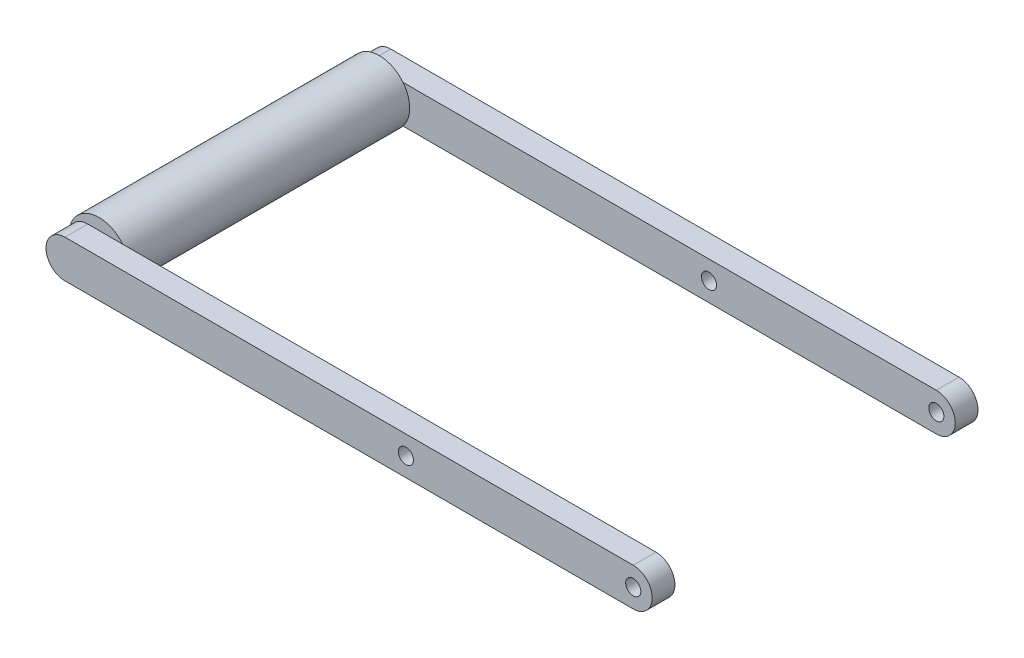
ISO-10303-21;
HEADER;
FILE_DESCRIPTION(('STEP AP214'),'2;1');
FILE_NAME('part.step','',(''),(''),'','','');
FILE_SCHEMA(('AUTOMOTIVE_DESIGN { 1 0 10303 214 1 1 1 1 }'));
ENDSEC;
DATA;
#1=APPLICATION_CONTEXT('core data for automotive mechanical design processes');
#2=APPLICATION_PROTOCOL_DEFINITION('international standard','automotive_design',2000,#1);
#3=PRODUCT_CONTEXT('',#1,'mechanical');
#4=PRODUCT('Part','Part','',(#3));
#5=PRODUCT_RELATED_PRODUCT_CATEGORY('part','',(#4));
#6=PRODUCT_DEFINITION_FORMATION('','',#4);
#7=PRODUCT_DEFINITION_CONTEXT('part definition',#1,'design');
#8=PRODUCT_DEFINITION('design','',#6,#7);
#9=PRODUCT_DEFINITION_SHAPE('','',#8);
#10=(LENGTH_UNIT() NAMED_UNIT(*) SI_UNIT(.MILLI.,.METRE.));
#11=(NAMED_UNIT(*) PLANE_ANGLE_UNIT() SI_UNIT($,.RADIAN.));
#12=(NAMED_UNIT(*) SI_UNIT($,.STERADIAN.) SOLID_ANGLE_UNIT());
#13=UNCERTAINTY_MEASURE_WITH_UNIT(LENGTH_MEASURE(1.E-05),#10,'distance_accuracy_value','');
#14=(GEOMETRIC_REPRESENTATION_CONTEXT(3) GLOBAL_UNCERTAINTY_ASSIGNED_CONTEXT((#13)) GLOBAL_UNIT_ASSIGNED_CONTEXT((#10,
#11,#12)) REPRESENTATION_CONTEXT('',''));
#15=CARTESIAN_POINT('',(0.,0.,0.));
#16=DIRECTION('',(0.,0.,1.));
#17=DIRECTION('',(1.,0.,0.));
#18=AXIS2_PLACEMENT_3D('',#15,#16,#17);
#19=CARTESIAN_POINT('',(-375.,0.,400.));
#20=DIRECTION('',(0.,0.,1.));
#21=DIRECTION('',(1.,0.,0.));
#22=AXIS2_PLACEMENT_3D('',#19,#20,#21);
#23=CYLINDRICAL_SURFACE('',#22,25.);
#24=DIRECTION('',(0.,0.,1.));
#25=VECTOR('',#24,1.);
#26=CARTESIAN_POINT('',(-375.,25.,400.));
#27=LINE('',#26,#25);
#28=CARTESIAN_POINT('',(-375.,25.,400.));
#29=VERTEX_POINT('',#28);
#30=CARTESIAN_POINT('',(-375.,25.,430.));
#31=VERTEX_POINT('',#30);
#32=EDGE_CURVE('E182',#29,#31,#27,.T.);
#33=ORIENTED_EDGE('',*,*,#32,.F.);
#34=CARTESIAN_POINT('',(-375.,0.,400.));
#35=DIRECTION('',(0.,0.,1.));
#36=DIRECTION('',(1.,0.,0.));
#37=AXIS2_PLACEMENT_3D('',#34,#35,#36);
#38=CIRCLE('',#37,25.);
#39=CARTESIAN_POINT('',(-375.,-25.,400.));
#40=VERTEX_POINT('',#39);
#41=EDGE_CURVE('E11',#40,#29,#38,.F.);
#42=ORIENTED_EDGE('',*,*,#41,.F.);
#43=DIRECTION('',(0.,0.,1.));
#44=VECTOR('',#43,1.);
#45=CARTESIAN_POINT('',(-375.,-25.,400.));
#46=LINE('',#45,#44);
#47=CARTESIAN_POINT('',(-375.,-25.,430.));
#48=VERTEX_POINT('',#47);
#49=EDGE_CURVE('E185',#48,#40,#46,.F.);
#50=ORIENTED_EDGE('',*,*,#49,.F.);
#51=CARTESIAN_POINT('',(-375.,0.,430.));
#52=DIRECTION('',(0.,0.,-1.));
#53=DIRECTION('',(-1.,0.,0.));
#54=AXIS2_PLACEMENT_3D('',#51,#52,#53);
#55=CIRCLE('',#54,25.);
#56=EDGE_CURVE('E48',#31,#48,#55,.F.);
#57=ORIENTED_EDGE('',*,*,#56,.F.);
#58=EDGE_LOOP('',(#33,#42,#50,#57));
#59=FACE_BOUND('',#58,.T.);
#60=ADVANCED_FACE('F39',(#59),#23,.T.);
#61=CARTESIAN_POINT('',(375.,0.,430.));
#62=DIRECTION('',(0.,0.,1.));
#63=DIRECTION('',(1.,0.,0.));
#64=AXIS2_PLACEMENT_3D('',#61,#62,#63);
#65=CYLINDRICAL_SURFACE('',#64,25.);
#66=DIRECTION('',(0.,0.,1.));
#67=VECTOR('',#66,1.);
#68=CARTESIAN_POINT('',(375.,25.,400.));
#69=LINE('',#68,#67);
#70=CARTESIAN_POINT('',(375.,25.,430.));
#71=VERTEX_POINT('',#70);
#72=CARTESIAN_POINT('',(375.,25.,400.));
#73=VERTEX_POINT('',#72);
#74=EDGE_CURVE('E171',#71,#73,#69,.F.);
#75=ORIENTED_EDGE('',*,*,#74,.F.);
#76=CARTESIAN_POINT('',(375.,0.,430.));
#77=DIRECTION('',(0.,0.,-1.));
#78=DIRECTION('',(-1.,0.,0.));
#79=AXIS2_PLACEMENT_3D('',#76,#77,#78);
#80=CIRCLE('',#79,25.);
#81=CARTESIAN_POINT('',(375.,-25.,430.));
#82=VERTEX_POINT('',#81);
#83=EDGE_CURVE('E178',#82,#71,#80,.F.);
#84=ORIENTED_EDGE('',*,*,#83,.F.);
#85=DIRECTION('',(0.,0.,1.));
#86=VECTOR('',#85,1.);
#87=CARTESIAN_POINT('',(375.,-25.,400.));
#88=LINE('',#87,#86);
#89=CARTESIAN_POINT('',(375.,-25.,400.));
#90=VERTEX_POINT('',#89);
#91=EDGE_CURVE('E174',#90,#82,#88,.T.);
#92=ORIENTED_EDGE('',*,*,#91,.F.);
#93=CARTESIAN_POINT('',(375.,0.,400.));
#94=DIRECTION('',(0.,0.,-1.));
#95=DIRECTION('',(-1.,0.,0.));
#96=AXIS2_PLACEMENT_3D('',#93,#94,#95);
#97=CIRCLE('',#96,25.);
#98=EDGE_CURVE('E180',#73,#90,#97,.T.);
#99=ORIENTED_EDGE('',*,*,#98,.F.);
#100=EDGE_LOOP('',(#75,#84,#92,#99));
#101=FACE_BOUND('',#100,.T.);
#102=ADVANCED_FACE('F250',(#101),#65,.T.);
#103=CARTESIAN_POINT('',(-375.,0.,0.));
#104=DIRECTION('',(0.,0.,-1.));
#105=DIRECTION('',(-1.,0.,0.));
#106=AXIS2_PLACEMENT_3D('',#103,#104,#105);
#107=CYLINDRICAL_SURFACE('',#106,25.);
#108=DIRECTION('',(0.,0.,-1.));
#109=VECTOR('',#108,1.);
#110=CARTESIAN_POINT('',(-375.,25.,30.));
#111=LINE('',#110,#109);
#112=CARTESIAN_POINT('',(-375.,25.,0.));
#113=VERTEX_POINT('',#112);
#114=CARTESIAN_POINT('',(-375.,25.,30.));
#115=VERTEX_POINT('',#114);
#116=EDGE_CURVE('E143',#113,#115,#111,.F.);
#117=ORIENTED_EDGE('',*,*,#116,.F.);
#118=CARTESIAN_POINT('',(-375.,0.,0.));
#119=DIRECTION('',(0.,0.,1.));
#120=DIRECTION('',(1.,0.,0.));
#121=AXIS2_PLACEMENT_3D('',#118,#119,#120);
#122=CIRCLE('',#121,25.);
#123=CARTESIAN_POINT('',(-375.,-25.,0.));
#124=VERTEX_POINT('',#123);
#125=EDGE_CURVE('E166',#124,#113,#122,.F.);
#126=ORIENTED_EDGE('',*,*,#125,.F.);
#127=DIRECTION('',(0.,0.,-1.));
#128=VECTOR('',#127,1.);
#129=CARTESIAN_POINT('',(-375.,-25.,30.));
#130=LINE('',#129,#128);
#131=CARTESIAN_POINT('',(-375.,-25.,30.));
#132=VERTEX_POINT('',#131);
#133=EDGE_CURVE('E163',#132,#124,#130,.T.);
#134=ORIENTED_EDGE('',*,*,#133,.F.);
#135=CARTESIAN_POINT('',(-375.,0.,30.));
#136=DIRECTION('',(0.,0.,1.));
#137=DIRECTION('',(1.,0.,0.));
#138=AXIS2_PLACEMENT_3D('',#135,#136,#137);
#139=CIRCLE('',#138,25.);
#140=EDGE_CURVE('E168',#115,#132,#139,.T.);
#141=ORIENTED_EDGE('',*,*,#140,.F.);
#142=EDGE_LOOP('',(#117,#126,#134,#141));
#143=FACE_BOUND('',#142,.T.);
#144=ADVANCED_FACE('F254',(#143),#107,.T.);
#145=CARTESIAN_POINT('',(375.,0.,30.));
#146=DIRECTION('',(0.,0.,-1.));
#147=DIRECTION('',(-1.,0.,0.));
#148=AXIS2_PLACEMENT_3D('',#145,#146,#147);
#149=CYLINDRICAL_SURFACE('',#148,25.);
#150=DIRECTION('',(0.,0.,-1.));
#151=VECTOR('',#150,1.);
#152=CARTESIAN_POINT('',(375.,25.,30.));
#153=LINE('',#152,#151);
#154=CARTESIAN_POINT('',(375.,25.,30.));
#155=VERTEX_POINT('',#154);
#156=CARTESIAN_POINT('',(375.,25.,0.));
#157=VERTEX_POINT('',#156);
#158=EDGE_CURVE('E124',#155,#157,#153,.T.);
#159=ORIENTED_EDGE('',*,*,#158,.F.);
#160=CARTESIAN_POINT('',(375.,0.,30.));
#161=DIRECTION('',(0.,0.,1.));
#162=DIRECTION('',(1.,0.,0.));
#163=AXIS2_PLACEMENT_3D('',#160,#161,#162);
#164=CIRCLE('',#163,25.);
#165=CARTESIAN_POINT('',(375.,-25.,30.));
#166=VERTEX_POINT('',#165);
#167=EDGE_CURVE('E133',#166,#155,#164,.T.);
#168=ORIENTED_EDGE('',*,*,#167,.F.);
#169=DIRECTION('',(0.,0.,-1.));
#170=VECTOR('',#169,1.);
#171=CARTESIAN_POINT('',(375.,-25.,30.));
#172=LINE('',#171,#170);
#173=CARTESIAN_POINT('',(375.,-25.,0.));
#174=VERTEX_POINT('',#173);
#175=EDGE_CURVE('E155',#174,#166,#172,.F.);
#176=ORIENTED_EDGE('',*,*,#175,.F.);
#177=CARTESIAN_POINT('',(375.,0.,0.));
#178=DIRECTION('',(0.,0.,1.));
#179=DIRECTION('',(1.,0.,0.));
#180=AXIS2_PLACEMENT_3D('',#177,#178,#179);
#181=CIRCLE('',#180,25.);
#182=EDGE_CURVE('E159',#157,#174,#181,.F.);
#183=ORIENTED_EDGE('',*,*,#182,.F.);
#184=EDGE_LOOP('',(#159,#168,#176,#183));
#185=FACE_BOUND('',#184,.T.);
#186=ADVANCED_FACE('F301',(#185),#149,.T.);
#187=CARTESIAN_POINT('',(-400.,25.,30.));
#188=DIRECTION('',(0.,-1.,0.));
#189=DIRECTION('',(0.,0.,-1.));
#190=AXIS2_PLACEMENT_3D('',#187,#188,#189);
#191=PLANE('',#190);
#192=DIRECTION('',(-1.,0.,0.));
#193=VECTOR('',#192,1.);
#194=CARTESIAN_POINT('',(-400.,25.,0.));
#195=LINE('',#194,#193);
#196=EDGE_CURVE('E151',#157,#113,#195,.T.);
#197=ORIENTED_EDGE('',*,*,#196,.T.);
#198=ORIENTED_EDGE('',*,*,#116,.T.);
#199=DIRECTION('',(-1.,0.,0.));
#200=VECTOR('',#199,1.);
#201=CARTESIAN_POINT('',(-400.,25.,30.));
#202=LINE('',#201,#200);
#203=CARTESIAN_POINT('',(-328.831625359183,25.,30.));
#204=VERTEX_POINT('',#203);
#205=EDGE_CURVE('E118',#204,#115,#202,.T.);
#206=ORIENTED_EDGE('',*,*,#205,.F.);
#207=EDGE_CURVE('E129',#155,#204,#202,.T.);
#208=ORIENTED_EDGE('',*,*,#207,.F.);
#209=ORIENTED_EDGE('',*,*,#158,.T.);
#210=EDGE_LOOP('',(#197,#198,#206,#208,#209));
#211=FACE_BOUND('',#210,.T.);
#212=ADVANCED_FACE('F141',(#211),#191,.F.);
#213=CARTESIAN_POINT('',(-400.,-25.,30.));
#214=DIRECTION('',(0.,1.,0.));
#215=DIRECTION('',(0.,0.,1.));
#216=AXIS2_PLACEMENT_3D('',#213,#214,#215);
#217=PLANE('',#216);
#218=DIRECTION('',(1.,0.,0.));
#219=VECTOR('',#218,1.);
#220=CARTESIAN_POINT('',(-400.,-25.,30.));
#221=LINE('',#220,#219);
#222=CARTESIAN_POINT('',(-328.831625359183,-25.,30.));
#223=VERTEX_POINT('',#222);
#224=EDGE_CURVE('E120',#132,#223,#221,.T.);
#225=ORIENTED_EDGE('',*,*,#224,.F.);
#226=ORIENTED_EDGE('',*,*,#133,.T.);
#227=DIRECTION('',(1.,0.,0.));
#228=VECTOR('',#227,1.);
#229=CARTESIAN_POINT('',(-400.,-25.,0.));
#230=LINE('',#229,#228);
#231=EDGE_CURVE('E144',#124,#174,#230,.T.);
#232=ORIENTED_EDGE('',*,*,#231,.T.);
#233=ORIENTED_EDGE('',*,*,#175,.T.);
#234=EDGE_CURVE('E137',#223,#166,#221,.T.);
#235=ORIENTED_EDGE('',*,*,#234,.F.);
#236=EDGE_LOOP('',(#225,#226,#232,#233,#235));
#237=FACE_BOUND('',#236,.T.);
#238=ADVANCED_FACE('F292',(#237),#217,.F.);
#239=CARTESIAN_POINT('',(0.,0.,30.));
#240=DIRECTION('',(0.,0.,1.));
#241=DIRECTION('',(1.,0.,0.));
#242=AXIS2_PLACEMENT_3D('',#239,#240,#241);
#243=PLANE('',#242);
#244=CARTESIAN_POINT('',(375.,0.,30.));
#245=DIRECTION('',(0.,0.,1.));
#246=DIRECTION('',(1.,0.,0.));
#247=AXIS2_PLACEMENT_3D('',#244,#245,#246);
#248=CIRCLE('',#247,9.99999999999998);
#249=CARTESIAN_POINT('',(385.,0.,30.));
#250=VERTEX_POINT('',#249);
#251=EDGE_CURVE('E222',#250,#250,#248,.T.);
#252=ORIENTED_EDGE('',*,*,#251,.F.);
#253=EDGE_LOOP('',(#252));
#254=FACE_BOUND('',#253,.T.);
#255=CARTESIAN_POINT('',(75.,0.,30.));
#256=DIRECTION('',(0.,0.,1.));
#257=DIRECTION('',(1.,0.,0.));
#258=AXIS2_PLACEMENT_3D('',#255,#256,#257);
#259=CIRCLE('',#258,9.99999999999998);
#260=CARTESIAN_POINT('',(85.,0.,30.));
#261=VERTEX_POINT('',#260);
#262=EDGE_CURVE('E209',#261,#261,#259,.T.);
#263=ORIENTED_EDGE('',*,*,#262,.F.);
#264=EDGE_LOOP('',(#263));
#265=FACE_BOUND('',#264,.T.);
#266=ORIENTED_EDGE('',*,*,#234,.T.);
#267=ORIENTED_EDGE('',*,*,#167,.T.);
#268=ORIENTED_EDGE('',*,*,#207,.T.);
#269=CARTESIAN_POINT('',(-360.056615351175,0.,30.));
#270=DIRECTION('',(0.,0.,1.));
#271=DIRECTION('',(1.,0.,0.));
#272=AXIS2_PLACEMENT_3D('',#269,#270,#271);
#273=CIRCLE('',#272,40.);
#274=EDGE_CURVE('E125',#223,#204,#273,.T.);
#275=ORIENTED_EDGE('',*,*,#274,.F.);
#276=EDGE_LOOP('',(#266,#267,#268,#275));
#277=FACE_BOUND('',#276,.T.);
#278=ADVANCED_FACE('F131',(#254,#265,#277),#243,.T.);
#279=CARTESIAN_POINT('',(0.,0.,0.));
#280=DIRECTION('',(0.,0.,1.));
#281=DIRECTION('',(1.,0.,0.));
#282=AXIS2_PLACEMENT_3D('',#279,#280,#281);
#283=PLANE('',#282);
#284=CARTESIAN_POINT('',(375.,0.,0.));
#285=DIRECTION('',(0.,0.,1.));
#286=DIRECTION('',(1.,0.,0.));
#287=AXIS2_PLACEMENT_3D('',#284,#285,#286);
#288=CIRCLE('',#287,9.99999999999998);
#289=CARTESIAN_POINT('',(385.,0.,0.));
#290=VERTEX_POINT('',#289);
#291=EDGE_CURVE('E228',#290,#290,#288,.T.);
#292=ORIENTED_EDGE('',*,*,#291,.T.);
#293=EDGE_LOOP('',(#292));
#294=FACE_BOUND('',#293,.T.);
#295=CARTESIAN_POINT('',(75.,0.,0.));
#296=DIRECTION('',(0.,0.,1.));
#297=DIRECTION('',(1.,0.,0.));
#298=AXIS2_PLACEMENT_3D('',#295,#296,#297);
#299=CIRCLE('',#298,9.99999999999998);
#300=CARTESIAN_POINT('',(85.,0.,0.));
#301=VERTEX_POINT('',#300);
#302=EDGE_CURVE('E219',#301,#301,#299,.T.);
#303=ORIENTED_EDGE('',*,*,#302,.T.);
#304=EDGE_LOOP('',(#303));
#305=FACE_BOUND('',#304,.T.);
#306=ORIENTED_EDGE('',*,*,#231,.F.);
#307=ORIENTED_EDGE('',*,*,#125,.T.);
#308=ORIENTED_EDGE('',*,*,#196,.F.);
#309=ORIENTED_EDGE('',*,*,#182,.T.);
#310=EDGE_LOOP('',(#306,#307,#308,#309));
#311=FACE_BOUND('',#310,.T.);
#312=ADVANCED_FACE('F235',(#294,#305,#311),#283,.F.);
#313=CARTESIAN_POINT('',(-360.056615351175,0.,30.));
#314=DIRECTION('',(0.,0.,1.));
#315=DIRECTION('',(1.,0.,0.));
#316=AXIS2_PLACEMENT_3D('',#313,#314,#315);
#317=PLANE('',#316);
#318=EDGE_CURVE('E114',#204,#223,#273,.T.);
#319=ORIENTED_EDGE('',*,*,#318,.F.);
#320=ORIENTED_EDGE('',*,*,#205,.T.);
#321=ORIENTED_EDGE('',*,*,#140,.T.);
#322=ORIENTED_EDGE('',*,*,#224,.T.);
#323=EDGE_LOOP('',(#319,#320,#321,#322));
#324=FACE_BOUND('',#323,.T.);
#325=ADVANCED_FACE('F116',(#324),#317,.F.);
#326=CARTESIAN_POINT('',(-360.056615351175,0.,400.));
#327=DIRECTION('',(0.,0.,-1.));
#328=DIRECTION('',(-1.,0.,0.));
#329=AXIS2_PLACEMENT_3D('',#326,#327,#328);
#330=CYLINDRICAL_SURFACE('',#329,40.);
#331=CARTESIAN_POINT('',(-360.056615351175,0.,400.));
#332=DIRECTION('',(0.,0.,1.));
#333=DIRECTION('',(1.,0.,0.));
#334=AXIS2_PLACEMENT_3D('',#331,#332,#333);
#335=CIRCLE('',#334,40.);
#336=CARTESIAN_POINT('',(-328.831625359183,25.,400.));
#337=VERTEX_POINT('',#336);
#338=CARTESIAN_POINT('',(-328.831625359183,-25.,400.));
#339=VERTEX_POINT('',#338);
#340=EDGE_CURVE('E148',#337,#339,#335,.T.);
#341=ORIENTED_EDGE('',*,*,#340,.F.);
#342=EDGE_CURVE('E207',#339,#337,#335,.T.);
#343=ORIENTED_EDGE('',*,*,#342,.F.);
#344=EDGE_LOOP('',(#341,#343));
#345=FACE_BOUND('',#344,.T.);
#346=ORIENTED_EDGE('',*,*,#274,.T.);
#347=ORIENTED_EDGE('',*,*,#318,.T.);
#348=EDGE_LOOP('',(#346,#347));
#349=FACE_BOUND('',#348,.T.);
#350=ADVANCED_FACE('F145',(#345,#349),#330,.T.);
#351=CARTESIAN_POINT('',(-360.056615351175,0.,400.));
#352=DIRECTION('',(0.,0.,1.));
#353=DIRECTION('',(1.,0.,0.));
#354=AXIS2_PLACEMENT_3D('',#351,#352,#353);
#355=PLANE('',#354);
#356=DIRECTION('',(-1.,0.,0.));
#357=VECTOR('',#356,1.);
#358=CARTESIAN_POINT('',(-400.,25.,400.));
#359=LINE('',#358,#357);
#360=EDGE_CURVE('E170',#337,#29,#359,.T.);
#361=ORIENTED_EDGE('',*,*,#360,.F.);
#362=ORIENTED_EDGE('',*,*,#340,.T.);
#363=DIRECTION('',(1.,0.,0.));
#364=VECTOR('',#363,1.);
#365=CARTESIAN_POINT('',(-400.,-25.,400.));
#366=LINE('',#365,#364);
#367=EDGE_CURVE('E175',#40,#339,#366,.T.);
#368=ORIENTED_EDGE('',*,*,#367,.F.);
#369=ORIENTED_EDGE('',*,*,#41,.T.);
#370=EDGE_LOOP('',(#361,#362,#368,#369));
#371=FACE_BOUND('',#370,.T.);
#372=ADVANCED_FACE('F197',(#371),#355,.T.);
#373=CARTESIAN_POINT('',(-400.,-25.,400.));
#374=DIRECTION('',(0.,-1.,0.));
#375=DIRECTION('',(0.,0.,-1.));
#376=AXIS2_PLACEMENT_3D('',#373,#374,#375);
#377=PLANE('',#376);
#378=DIRECTION('',(1.,0.,0.));
#379=VECTOR('',#378,1.);
#380=CARTESIAN_POINT('',(-400.,-25.,430.));
#381=LINE('',#380,#379);
#382=EDGE_CURVE('E194',#48,#82,#381,.T.);
#383=ORIENTED_EDGE('',*,*,#382,.F.);
#384=ORIENTED_EDGE('',*,*,#49,.T.);
#385=ORIENTED_EDGE('',*,*,#367,.T.);
#386=EDGE_CURVE('E200',#339,#90,#366,.T.);
#387=ORIENTED_EDGE('',*,*,#386,.T.);
#388=ORIENTED_EDGE('',*,*,#91,.T.);
#389=EDGE_LOOP('',(#383,#384,#385,#387,#388));
#390=FACE_BOUND('',#389,.T.);
#391=ADVANCED_FACE('F191',(#390),#377,.T.);
#392=CARTESIAN_POINT('',(-400.,25.,400.));
#393=DIRECTION('',(0.,1.,0.));
#394=DIRECTION('',(0.,0.,1.));
#395=AXIS2_PLACEMENT_3D('',#392,#393,#394);
#396=PLANE('',#395);
#397=ORIENTED_EDGE('',*,*,#360,.T.);
#398=ORIENTED_EDGE('',*,*,#32,.T.);
#399=DIRECTION('',(-1.,0.,0.));
#400=VECTOR('',#399,1.);
#401=CARTESIAN_POINT('',(-400.,25.,430.));
#402=LINE('',#401,#400);
#403=EDGE_CURVE('E205',#71,#31,#402,.T.);
#404=ORIENTED_EDGE('',*,*,#403,.F.);
#405=ORIENTED_EDGE('',*,*,#74,.T.);
#406=EDGE_CURVE('E203',#73,#337,#359,.T.);
#407=ORIENTED_EDGE('',*,*,#406,.T.);
#408=EDGE_LOOP('',(#397,#398,#404,#405,#407));
#409=FACE_BOUND('',#408,.T.);
#410=ADVANCED_FACE('F257',(#409),#396,.T.);
#411=CARTESIAN_POINT('',(0.,0.,400.));
#412=DIRECTION('',(0.,0.,-1.));
#413=DIRECTION('',(1.,0.,0.));
#414=AXIS2_PLACEMENT_3D('',#411,#412,#413);
#415=PLANE('',#414);
#416=CARTESIAN_POINT('',(375.,0.,400.));
#417=DIRECTION('',(0.,0.,-1.));
#418=DIRECTION('',(-1.,0.,0.));
#419=AXIS2_PLACEMENT_3D('',#416,#417,#418);
#420=CIRCLE('',#419,9.99999999999998);
#421=CARTESIAN_POINT('',(365.,0.,400.));
#422=VERTEX_POINT('',#421);
#423=EDGE_CURVE('E225',#422,#422,#420,.T.);
#424=ORIENTED_EDGE('',*,*,#423,.F.);
#425=EDGE_LOOP('',(#424));
#426=FACE_BOUND('',#425,.T.);
#427=CARTESIAN_POINT('',(75.,0.,400.));
#428=DIRECTION('',(0.,0.,-1.));
#429=DIRECTION('',(-1.,0.,0.));
#430=AXIS2_PLACEMENT_3D('',#427,#428,#429);
#431=CIRCLE('',#430,9.99999999999998);
#432=CARTESIAN_POINT('',(65.,0.,400.));
#433=VERTEX_POINT('',#432);
#434=EDGE_CURVE('E213',#433,#433,#431,.T.);
#435=ORIENTED_EDGE('',*,*,#434,.F.);
#436=EDGE_LOOP('',(#435));
#437=FACE_BOUND('',#436,.T.);
#438=ORIENTED_EDGE('',*,*,#406,.F.);
#439=ORIENTED_EDGE('',*,*,#98,.T.);
#440=ORIENTED_EDGE('',*,*,#386,.F.);
#441=ORIENTED_EDGE('',*,*,#342,.T.);
#442=EDGE_LOOP('',(#438,#439,#440,#441));
#443=FACE_BOUND('',#442,.T.);
#444=ADVANCED_FACE('F262',(#426,#437,#443),#415,.T.);
#445=CARTESIAN_POINT('',(0.,0.,430.));
#446=DIRECTION('',(0.,0.,-1.));
#447=DIRECTION('',(1.,0.,0.));
#448=AXIS2_PLACEMENT_3D('',#445,#446,#447);
#449=PLANE('',#448);
#450=CARTESIAN_POINT('',(375.,0.,430.));
#451=DIRECTION('',(0.,0.,1.));
#452=DIRECTION('',(1.,0.,0.));
#453=AXIS2_PLACEMENT_3D('',#450,#451,#452);
#454=CIRCLE('',#453,9.99999999999998);
#455=CARTESIAN_POINT('',(385.,0.,430.));
#456=VERTEX_POINT('',#455);
#457=EDGE_CURVE('E229',#456,#456,#454,.T.);
#458=ORIENTED_EDGE('',*,*,#457,.F.);
#459=EDGE_LOOP('',(#458));
#460=FACE_BOUND('',#459,.T.);
#461=CARTESIAN_POINT('',(75.,0.,430.));
#462=DIRECTION('',(0.,0.,-1.));
#463=DIRECTION('',(-1.,0.,0.));
#464=AXIS2_PLACEMENT_3D('',#461,#462,#463);
#465=CIRCLE('',#464,9.99999999999998);
#466=CARTESIAN_POINT('',(65.,0.,430.));
#467=VERTEX_POINT('',#466);
#468=EDGE_CURVE('E43',#467,#467,#465,.T.);
#469=ORIENTED_EDGE('',*,*,#468,.T.);
#470=EDGE_LOOP('',(#469));
#471=FACE_BOUND('',#470,.T.);
#472=ORIENTED_EDGE('',*,*,#403,.T.);
#473=ORIENTED_EDGE('',*,*,#56,.T.);
#474=ORIENTED_EDGE('',*,*,#382,.T.);
#475=ORIENTED_EDGE('',*,*,#83,.T.);
#476=EDGE_LOOP('',(#472,#473,#474,#475));
#477=FACE_BOUND('',#476,.T.);
#478=ADVANCED_FACE('F265',(#460,#471,#477),#449,.F.);
#479=CARTESIAN_POINT('',(75.,0.,0.));
#480=DIRECTION('',(0.,0.,1.));
#481=DIRECTION('',(1.,0.,0.));
#482=AXIS2_PLACEMENT_3D('',#479,#480,#481);
#483=CYLINDRICAL_SURFACE('',#482,9.99999999999998);
#484=ORIENTED_EDGE('',*,*,#434,.T.);
#485=EDGE_LOOP('',(#484));
#486=FACE_BOUND('',#485,.T.);
#487=ORIENTED_EDGE('',*,*,#468,.F.);
#488=EDGE_LOOP('',(#487));
#489=FACE_BOUND('',#488,.T.);
#490=ADVANCED_FACE('F267',(#486,#489),#483,.F.);
#491=ORIENTED_EDGE('',*,*,#262,.T.);
#492=EDGE_LOOP('',(#491));
#493=FACE_BOUND('',#492,.T.);
#494=ORIENTED_EDGE('',*,*,#302,.F.);
#495=EDGE_LOOP('',(#494));
#496=FACE_BOUND('',#495,.T.);
#497=ADVANCED_FACE('F246',(#493,#496),#483,.F.);
#498=CARTESIAN_POINT('',(375.,0.,0.));
#499=DIRECTION('',(0.,0.,1.));
#500=DIRECTION('',(1.,0.,0.));
#501=AXIS2_PLACEMENT_3D('',#498,#499,#500);
#502=CYLINDRICAL_SURFACE('',#501,9.99999999999998);
#503=ORIENTED_EDGE('',*,*,#423,.T.);
#504=EDGE_LOOP('',(#503));
#505=FACE_BOUND('',#504,.T.);
#506=ORIENTED_EDGE('',*,*,#457,.T.);
#507=EDGE_LOOP('',(#506));
#508=FACE_BOUND('',#507,.T.);
#509=ADVANCED_FACE('F240',(#505,#508),#502,.F.);
#510=ORIENTED_EDGE('',*,*,#251,.T.);
#511=EDGE_LOOP('',(#510));
#512=FACE_BOUND('',#511,.T.);
#513=ORIENTED_EDGE('',*,*,#291,.F.);
#514=EDGE_LOOP('',(#513));
#515=FACE_BOUND('',#514,.T.);
#516=ADVANCED_FACE('F238',(#512,#515),#502,.F.);
#517=CLOSED_SHELL('',(#60,#102,#144,#186,#212,#238,#278,#312,#325,#350,#372,#391,#410,#444,#478,
#490,#497,#509,#516));
#518=MANIFOLD_SOLID_BREP('B2',#517);
#519=ADVANCED_BREP_SHAPE_REPRESENTATION('',(#18,#518),#14);
#520=SHAPE_DEFINITION_REPRESENTATION(#9,#519);
ENDSEC;
END-ISO-10303-21;
